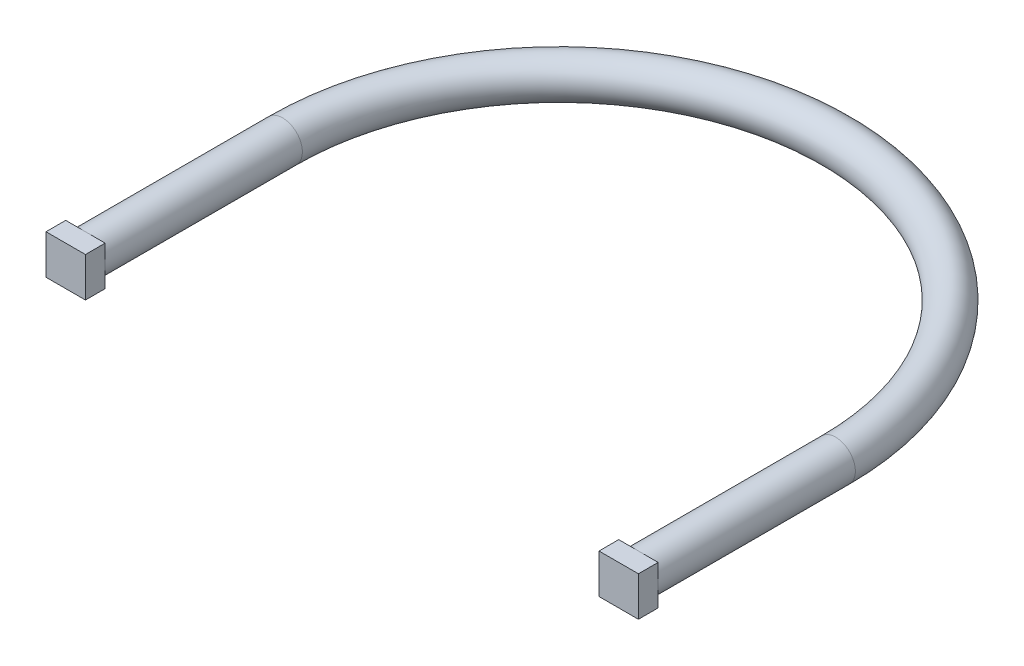
ISO-10303-21;
HEADER;
FILE_DESCRIPTION(('STEP AP214'),'2;1');
FILE_NAME('part.step','',(''),(''),'','','');
FILE_SCHEMA(('AUTOMOTIVE_DESIGN { 1 0 10303 214 1 1 1 1 }'));
ENDSEC;
DATA;
#1=APPLICATION_CONTEXT('core data for automotive mechanical design processes');
#2=APPLICATION_PROTOCOL_DEFINITION('international standard','automotive_design',2000,#1);
#3=PRODUCT_CONTEXT('',#1,'mechanical');
#4=PRODUCT('Part','Part','',(#3));
#5=PRODUCT_RELATED_PRODUCT_CATEGORY('part','',(#4));
#6=PRODUCT_DEFINITION_FORMATION('','',#4);
#7=PRODUCT_DEFINITION_CONTEXT('part definition',#1,'design');
#8=PRODUCT_DEFINITION('design','',#6,#7);
#9=PRODUCT_DEFINITION_SHAPE('','',#8);
#10=(LENGTH_UNIT() NAMED_UNIT(*) SI_UNIT(.MILLI.,.METRE.));
#11=(NAMED_UNIT(*) PLANE_ANGLE_UNIT() SI_UNIT($,.RADIAN.));
#12=(NAMED_UNIT(*) SI_UNIT($,.STERADIAN.) SOLID_ANGLE_UNIT());
#13=UNCERTAINTY_MEASURE_WITH_UNIT(LENGTH_MEASURE(1.E-05),#10,'distance_accuracy_value','');
#14=(GEOMETRIC_REPRESENTATION_CONTEXT(3) GLOBAL_UNCERTAINTY_ASSIGNED_CONTEXT((#13)) GLOBAL_UNIT_ASSIGNED_CONTEXT((#10,
#11,#12)) REPRESENTATION_CONTEXT('',''));
#15=CARTESIAN_POINT('',(0.,0.,0.));
#16=DIRECTION('',(0.,0.,1.));
#17=DIRECTION('',(1.,0.,0.));
#18=AXIS2_PLACEMENT_3D('',#15,#16,#17);
#19=CARTESIAN_POINT('',(140.2,0.,-50.));
#20=DIRECTION('',(0.,0.,1.));
#21=DIRECTION('',(1.,0.,0.));
#22=AXIS2_PLACEMENT_3D('',#19,#20,#21);
#23=CYLINDRICAL_SURFACE('',#22,5.);
#24=CARTESIAN_POINT('',(140.2,0.,-50.));
#25=DIRECTION('',(0.,0.,-1.));
#26=DIRECTION('',(-1.,0.,0.));
#27=AXIS2_PLACEMENT_3D('',#24,#25,#26);
#28=CIRCLE('',#27,5.);
#29=CARTESIAN_POINT('',(145.2,0.,-50.));
#30=VERTEX_POINT('',#29);
#31=EDGE_CURVE('E191',#30,#30,#28,.T.);
#32=ORIENTED_EDGE('',*,*,#31,.F.);
#33=EDGE_LOOP('',(#32));
#34=FACE_BOUND('',#33,.T.);
#35=CARTESIAN_POINT('',(140.2,0.,0.));
#36=DIRECTION('',(0.,0.,-1.));
#37=DIRECTION('',(-1.,0.,0.));
#38=AXIS2_PLACEMENT_3D('',#35,#36,#37);
#39=CIRCLE('',#38,5.);
#40=CARTESIAN_POINT('',(135.2,0.,0.));
#41=VERTEX_POINT('',#40);
#42=CARTESIAN_POINT('',(140.2,5.,0.));
#43=VERTEX_POINT('',#42);
#44=EDGE_CURVE('E11',#41,#43,#39,.T.);
#45=ORIENTED_EDGE('',*,*,#44,.T.);
#46=CARTESIAN_POINT('',(145.2,0.,0.));
#47=VERTEX_POINT('',#46);
#48=EDGE_CURVE('E40',#43,#47,#39,.T.);
#49=ORIENTED_EDGE('',*,*,#48,.T.);
#50=CARTESIAN_POINT('',(140.2,-5.,0.));
#51=VERTEX_POINT('',#50);
#52=EDGE_CURVE('E199',#47,#51,#39,.T.);
#53=ORIENTED_EDGE('',*,*,#52,.T.);
#54=EDGE_CURVE('E41',#51,#41,#39,.T.);
#55=ORIENTED_EDGE('',*,*,#54,.T.);
#56=EDGE_LOOP('',(#45,#49,#53,#55));
#57=FACE_BOUND('',#56,.T.);
#58=ADVANCED_FACE('F33',(#34,#57),#23,.T.);
#59=CARTESIAN_POINT('',(70.1,0.,-50.));
#60=DIRECTION('',(0.,-1.,0.));
#61=DIRECTION('',(0.,0.,-1.));
#62=AXIS2_PLACEMENT_3D('',#59,#60,#61);
#63=TOROIDAL_SURFACE('',#62,70.1,5.);
#64=CARTESIAN_POINT('',(0.,0.,-50.));
#65=DIRECTION('',(0.,0.,1.));
#66=DIRECTION('',(1.,0.,0.));
#67=AXIS2_PLACEMENT_3D('',#64,#65,#66);
#68=CIRCLE('',#67,5.);
#69=CARTESIAN_POINT('',(-5.,0.,-50.));
#70=VERTEX_POINT('',#69);
#71=EDGE_CURVE('E188',#70,#70,#68,.T.);
#72=CARTESIAN_POINT('',(70.1,0.,-50.));
#73=DIRECTION('',(0.,-1.,0.));
#74=DIRECTION('',(0.,0.,-1.));
#75=AXIS2_PLACEMENT_3D('',#72,#73,#74);
#76=CIRCLE('',#75,75.1);
#77=EDGE_CURVE('',#70,#30,#76,.T.);
#78=ORIENTED_EDGE('',*,*,#71,.F.);
#79=ORIENTED_EDGE('',*,*,#31,.T.);
#80=ORIENTED_EDGE('',*,*,#77,.T.);
#81=ORIENTED_EDGE('',*,*,#77,.F.);
#82=EDGE_LOOP('',(#78,#80,#79,#81));
#83=FACE_BOUND('',#82,.T.);
#84=ADVANCED_FACE('F247',(#83),#63,.T.);
#85=CARTESIAN_POINT('',(0.,0.,-50.));
#86=DIRECTION('',(0.,0.,1.));
#87=DIRECTION('',(1.,0.,0.));
#88=AXIS2_PLACEMENT_3D('',#85,#86,#87);
#89=CYLINDRICAL_SURFACE('',#88,5.);
#90=ORIENTED_EDGE('',*,*,#71,.T.);
#91=EDGE_LOOP('',(#90));
#92=FACE_BOUND('',#91,.T.);
#93=CARTESIAN_POINT('',(0.,0.,0.));
#94=DIRECTION('',(0.,0.,1.));
#95=DIRECTION('',(1.,0.,0.));
#96=AXIS2_PLACEMENT_3D('',#93,#94,#95);
#97=CIRCLE('',#96,5.);
#98=CARTESIAN_POINT('',(5.,0.,0.));
#99=VERTEX_POINT('',#98);
#100=CARTESIAN_POINT('',(0.,5.,0.));
#101=VERTEX_POINT('',#100);
#102=EDGE_CURVE('E192',#99,#101,#97,.T.);
#103=ORIENTED_EDGE('',*,*,#102,.F.);
#104=CARTESIAN_POINT('',(0.,-5.,0.));
#105=VERTEX_POINT('',#104);
#106=EDGE_CURVE('E56',#105,#99,#97,.T.);
#107=ORIENTED_EDGE('',*,*,#106,.F.);
#108=CARTESIAN_POINT('',(-5.,0.,0.));
#109=VERTEX_POINT('',#108);
#110=EDGE_CURVE('E430',#109,#105,#97,.T.);
#111=ORIENTED_EDGE('',*,*,#110,.F.);
#112=EDGE_CURVE('E194',#101,#109,#97,.T.);
#113=ORIENTED_EDGE('',*,*,#112,.F.);
#114=EDGE_LOOP('',(#103,#107,#111,#113));
#115=FACE_BOUND('',#114,.T.);
#116=ADVANCED_FACE('F252',(#92,#115),#89,.T.);
#117=CARTESIAN_POINT('',(0.,0.,0.));
#118=DIRECTION('',(0.,0.,-1.));
#119=DIRECTION('',(-1.,0.,0.));
#120=AXIS2_PLACEMENT_3D('',#117,#118,#119);
#121=PLANE('',#120);
#122=DIRECTION('',(0.,1.,0.));
#123=VECTOR('',#122,1.);
#124=CARTESIAN_POINT('',(5.,5.,0.));
#125=LINE('',#124,#123);
#126=CARTESIAN_POINT('',(5.,5.,0.));
#127=VERTEX_POINT('',#126);
#128=EDGE_CURVE('E146',#99,#127,#125,.T.);
#129=ORIENTED_EDGE('',*,*,#128,.F.);
#130=ORIENTED_EDGE('',*,*,#102,.T.);
#131=DIRECTION('',(-1.,0.,0.));
#132=VECTOR('',#131,1.);
#133=CARTESIAN_POINT('',(-5.,5.,0.));
#134=LINE('',#133,#132);
#135=EDGE_CURVE('E167',#127,#101,#134,.T.);
#136=ORIENTED_EDGE('',*,*,#135,.F.);
#137=EDGE_LOOP('',(#129,#130,#136));
#138=FACE_BOUND('',#137,.T.);
#139=ADVANCED_FACE('F257',(#138),#121,.T.);
#140=CARTESIAN_POINT('',(-5.,5.,0.));
#141=VERTEX_POINT('',#140);
#142=EDGE_CURVE('E166',#101,#141,#134,.T.);
#143=ORIENTED_EDGE('',*,*,#142,.F.);
#144=ORIENTED_EDGE('',*,*,#112,.T.);
#145=DIRECTION('',(0.,-1.,0.));
#146=VECTOR('',#145,1.);
#147=CARTESIAN_POINT('',(-5.,-5.,0.));
#148=LINE('',#147,#146);
#149=EDGE_CURVE('E171',#141,#109,#148,.T.);
#150=ORIENTED_EDGE('',*,*,#149,.F.);
#151=EDGE_LOOP('',(#143,#144,#150));
#152=FACE_BOUND('',#151,.T.);
#153=ADVANCED_FACE('F393',(#152),#121,.T.);
#154=CARTESIAN_POINT('',(-5.,-5.,0.));
#155=VERTEX_POINT('',#154);
#156=EDGE_CURVE('E170',#109,#155,#148,.T.);
#157=ORIENTED_EDGE('',*,*,#156,.F.);
#158=ORIENTED_EDGE('',*,*,#110,.T.);
#159=DIRECTION('',(1.,0.,0.));
#160=VECTOR('',#159,1.);
#161=CARTESIAN_POINT('',(5.,-5.,0.));
#162=LINE('',#161,#160);
#163=EDGE_CURVE('E158',#155,#105,#162,.T.);
#164=ORIENTED_EDGE('',*,*,#163,.F.);
#165=EDGE_LOOP('',(#157,#158,#164));
#166=FACE_BOUND('',#165,.T.);
#167=ADVANCED_FACE('F266',(#166),#121,.T.);
#168=CARTESIAN_POINT('',(5.,5.,5.));
#169=DIRECTION('',(-1.,0.,0.));
#170=DIRECTION('',(0.,0.,1.));
#171=AXIS2_PLACEMENT_3D('',#168,#169,#170);
#172=PLANE('',#171);
#173=CARTESIAN_POINT('',(5.,-5.,0.));
#174=VERTEX_POINT('',#173);
#175=EDGE_CURVE('E148',#174,#99,#125,.T.);
#176=ORIENTED_EDGE('',*,*,#175,.T.);
#177=ORIENTED_EDGE('',*,*,#128,.T.);
#178=DIRECTION('',(0.,0.,-1.));
#179=VECTOR('',#178,1.);
#180=CARTESIAN_POINT('',(5.,5.,5.));
#181=LINE('',#180,#179);
#182=CARTESIAN_POINT('',(5.,5.,5.));
#183=VERTEX_POINT('',#182);
#184=EDGE_CURVE('E185',#183,#127,#181,.T.);
#185=ORIENTED_EDGE('',*,*,#184,.F.);
#186=DIRECTION('',(0.,1.,0.));
#187=VECTOR('',#186,1.);
#188=CARTESIAN_POINT('',(5.,5.,5.));
#189=LINE('',#188,#187);
#190=CARTESIAN_POINT('',(5.,-5.,5.));
#191=VERTEX_POINT('',#190);
#192=EDGE_CURVE('E154',#191,#183,#189,.T.);
#193=ORIENTED_EDGE('',*,*,#192,.F.);
#194=DIRECTION('',(0.,0.,-1.));
#195=VECTOR('',#194,1.);
#196=CARTESIAN_POINT('',(5.,-5.,5.));
#197=LINE('',#196,#195);
#198=EDGE_CURVE('E163',#191,#174,#197,.T.);
#199=ORIENTED_EDGE('',*,*,#198,.T.);
#200=EDGE_LOOP('',(#176,#177,#185,#193,#199));
#201=FACE_BOUND('',#200,.T.);
#202=ADVANCED_FACE('F262',(#201),#172,.F.);
#203=CARTESIAN_POINT('',(-5.,5.,5.));
#204=DIRECTION('',(0.,-1.,0.));
#205=DIRECTION('',(0.,0.,-1.));
#206=AXIS2_PLACEMENT_3D('',#203,#204,#205);
#207=PLANE('',#206);
#208=ORIENTED_EDGE('',*,*,#135,.T.);
#209=ORIENTED_EDGE('',*,*,#142,.T.);
#210=DIRECTION('',(0.,0.,-1.));
#211=VECTOR('',#210,1.);
#212=CARTESIAN_POINT('',(-5.,5.,5.));
#213=LINE('',#212,#211);
#214=CARTESIAN_POINT('',(-5.,5.,5.));
#215=VERTEX_POINT('',#214);
#216=EDGE_CURVE('E182',#215,#141,#213,.T.);
#217=ORIENTED_EDGE('',*,*,#216,.F.);
#218=DIRECTION('',(-1.,0.,0.));
#219=VECTOR('',#218,1.);
#220=CARTESIAN_POINT('',(-5.,5.,5.));
#221=LINE('',#220,#219);
#222=EDGE_CURVE('E157',#183,#215,#221,.T.);
#223=ORIENTED_EDGE('',*,*,#222,.F.);
#224=ORIENTED_EDGE('',*,*,#184,.T.);
#225=EDGE_LOOP('',(#208,#209,#217,#223,#224));
#226=FACE_BOUND('',#225,.T.);
#227=ADVANCED_FACE('F265',(#226),#207,.F.);
#228=CARTESIAN_POINT('',(-5.,-5.,5.));
#229=DIRECTION('',(1.,0.,0.));
#230=DIRECTION('',(0.,0.,-1.));
#231=AXIS2_PLACEMENT_3D('',#228,#229,#230);
#232=PLANE('',#231);
#233=ORIENTED_EDGE('',*,*,#149,.T.);
#234=ORIENTED_EDGE('',*,*,#156,.T.);
#235=DIRECTION('',(0.,0.,-1.));
#236=VECTOR('',#235,1.);
#237=CARTESIAN_POINT('',(-5.,-5.,5.));
#238=LINE('',#237,#236);
#239=CARTESIAN_POINT('',(-5.,-5.,5.));
#240=VERTEX_POINT('',#239);
#241=EDGE_CURVE('E179',#240,#155,#238,.T.);
#242=ORIENTED_EDGE('',*,*,#241,.F.);
#243=DIRECTION('',(0.,-1.,0.));
#244=VECTOR('',#243,1.);
#245=CARTESIAN_POINT('',(-5.,-5.,5.));
#246=LINE('',#245,#244);
#247=EDGE_CURVE('E160',#215,#240,#246,.T.);
#248=ORIENTED_EDGE('',*,*,#247,.F.);
#249=ORIENTED_EDGE('',*,*,#216,.T.);
#250=EDGE_LOOP('',(#233,#234,#242,#248,#249));
#251=FACE_BOUND('',#250,.T.);
#252=ADVANCED_FACE('F270',(#251),#232,.F.);
#253=CARTESIAN_POINT('',(5.,-5.,5.));
#254=DIRECTION('',(0.,1.,0.));
#255=DIRECTION('',(-1.,0.,0.));
#256=AXIS2_PLACEMENT_3D('',#253,#254,#255);
#257=PLANE('',#256);
#258=ORIENTED_EDGE('',*,*,#163,.T.);
#259=EDGE_CURVE('E174',#105,#174,#162,.T.);
#260=ORIENTED_EDGE('',*,*,#259,.T.);
#261=ORIENTED_EDGE('',*,*,#198,.F.);
#262=DIRECTION('',(1.,0.,0.));
#263=VECTOR('',#262,1.);
#264=CARTESIAN_POINT('',(5.,-5.,5.));
#265=LINE('',#264,#263);
#266=EDGE_CURVE('E162',#240,#191,#265,.T.);
#267=ORIENTED_EDGE('',*,*,#266,.F.);
#268=ORIENTED_EDGE('',*,*,#241,.T.);
#269=EDGE_LOOP('',(#258,#260,#261,#267,#268));
#270=FACE_BOUND('',#269,.T.);
#271=ADVANCED_FACE('F274',(#270),#257,.F.);
#272=CARTESIAN_POINT('',(0.,0.,5.));
#273=DIRECTION('',(0.,0.,-1.));
#274=DIRECTION('',(-1.,0.,0.));
#275=AXIS2_PLACEMENT_3D('',#272,#273,#274);
#276=PLANE('',#275);
#277=ORIENTED_EDGE('',*,*,#192,.T.);
#278=ORIENTED_EDGE('',*,*,#222,.T.);
#279=ORIENTED_EDGE('',*,*,#247,.T.);
#280=ORIENTED_EDGE('',*,*,#266,.T.);
#281=EDGE_LOOP('',(#277,#278,#279,#280));
#282=FACE_BOUND('',#281,.T.);
#283=ADVANCED_FACE('F278',(#282),#276,.F.);
#284=ORIENTED_EDGE('',*,*,#259,.F.);
#285=ORIENTED_EDGE('',*,*,#106,.T.);
#286=ORIENTED_EDGE('',*,*,#175,.F.);
#287=EDGE_LOOP('',(#284,#285,#286));
#288=FACE_BOUND('',#287,.T.);
#289=ADVANCED_FACE('F280',(#288),#121,.T.);
#290=CARTESIAN_POINT('',(0.,0.,0.));
#291=DIRECTION('',(0.,0.,-1.));
#292=DIRECTION('',(-1.,0.,0.));
#293=AXIS2_PLACEMENT_3D('',#290,#291,#292);
#294=PLANE('',#293);
#295=ORIENTED_EDGE('',*,*,#44,.F.);
#296=DIRECTION('',(0.,-1.,0.));
#297=VECTOR('',#296,1.);
#298=CARTESIAN_POINT('',(135.2,-5.,0.));
#299=LINE('',#298,#297);
#300=CARTESIAN_POINT('',(135.2,5.,0.));
#301=VERTEX_POINT('',#300);
#302=EDGE_CURVE('E48',#301,#41,#299,.T.);
#303=ORIENTED_EDGE('',*,*,#302,.F.);
#304=DIRECTION('',(-1.,0.,0.));
#305=VECTOR('',#304,1.);
#306=CARTESIAN_POINT('',(135.2,5.,0.));
#307=LINE('',#306,#305);
#308=EDGE_CURVE('E213',#43,#301,#307,.T.);
#309=ORIENTED_EDGE('',*,*,#308,.F.);
#310=EDGE_LOOP('',(#295,#303,#309));
#311=FACE_BOUND('',#310,.T.);
#312=ADVANCED_FACE('F214',(#311),#294,.T.);
#313=ORIENTED_EDGE('',*,*,#48,.F.);
#314=CARTESIAN_POINT('',(145.2,5.,0.));
#315=VERTEX_POINT('',#314);
#316=EDGE_CURVE('E141',#315,#43,#307,.T.);
#317=ORIENTED_EDGE('',*,*,#316,.F.);
#318=DIRECTION('',(0.,1.,0.));
#319=VECTOR('',#318,1.);
#320=CARTESIAN_POINT('',(145.2,-5.,0.));
#321=LINE('',#320,#319);
#322=EDGE_CURVE('E210',#47,#315,#321,.T.);
#323=ORIENTED_EDGE('',*,*,#322,.F.);
#324=EDGE_LOOP('',(#313,#317,#323));
#325=FACE_BOUND('',#324,.T.);
#326=ADVANCED_FACE('F208',(#325),#294,.T.);
#327=ORIENTED_EDGE('',*,*,#52,.F.);
#328=CARTESIAN_POINT('',(145.2,-5.,0.));
#329=VERTEX_POINT('',#328);
#330=EDGE_CURVE('E216',#329,#47,#321,.T.);
#331=ORIENTED_EDGE('',*,*,#330,.F.);
#332=DIRECTION('',(1.,0.,0.));
#333=VECTOR('',#332,1.);
#334=CARTESIAN_POINT('',(135.2,-5.,0.));
#335=LINE('',#334,#333);
#336=EDGE_CURVE('E228',#51,#329,#335,.T.);
#337=ORIENTED_EDGE('',*,*,#336,.F.);
#338=EDGE_LOOP('',(#327,#331,#337));
#339=FACE_BOUND('',#338,.T.);
#340=ADVANCED_FACE('F235',(#339),#294,.T.);
#341=ORIENTED_EDGE('',*,*,#54,.F.);
#342=CARTESIAN_POINT('',(135.2,-5.,0.));
#343=VERTEX_POINT('',#342);
#344=EDGE_CURVE('E229',#343,#51,#335,.T.);
#345=ORIENTED_EDGE('',*,*,#344,.F.);
#346=EDGE_CURVE('E144',#41,#343,#299,.T.);
#347=ORIENTED_EDGE('',*,*,#346,.F.);
#348=EDGE_LOOP('',(#341,#345,#347));
#349=FACE_BOUND('',#348,.T.);
#350=ADVANCED_FACE('F237',(#349),#294,.T.);
#351=CARTESIAN_POINT('',(135.2,-5.,5.));
#352=DIRECTION('',(1.,0.,0.));
#353=DIRECTION('',(0.,0.,-1.));
#354=AXIS2_PLACEMENT_3D('',#351,#352,#353);
#355=PLANE('',#354);
#356=ORIENTED_EDGE('',*,*,#302,.T.);
#357=ORIENTED_EDGE('',*,*,#346,.T.);
#358=DIRECTION('',(0.,0.,-1.));
#359=VECTOR('',#358,1.);
#360=CARTESIAN_POINT('',(135.2,-5.,5.));
#361=LINE('',#360,#359);
#362=CARTESIAN_POINT('',(135.2,-5.,5.));
#363=VERTEX_POINT('',#362);
#364=EDGE_CURVE('E128',#363,#343,#361,.T.);
#365=ORIENTED_EDGE('',*,*,#364,.F.);
#366=DIRECTION('',(0.,-1.,0.));
#367=VECTOR('',#366,1.);
#368=CARTESIAN_POINT('',(135.2,-5.,5.));
#369=LINE('',#368,#367);
#370=CARTESIAN_POINT('',(135.2,5.,5.));
#371=VERTEX_POINT('',#370);
#372=EDGE_CURVE('E134',#371,#363,#369,.T.);
#373=ORIENTED_EDGE('',*,*,#372,.F.);
#374=DIRECTION('',(0.,0.,-1.));
#375=VECTOR('',#374,1.);
#376=CARTESIAN_POINT('',(135.2,5.,5.));
#377=LINE('',#376,#375);
#378=EDGE_CURVE('E224',#371,#301,#377,.T.);
#379=ORIENTED_EDGE('',*,*,#378,.T.);
#380=EDGE_LOOP('',(#356,#357,#365,#373,#379));
#381=FACE_BOUND('',#380,.T.);
#382=ADVANCED_FACE('F143',(#381),#355,.F.);
#383=CARTESIAN_POINT('',(135.2,-5.,5.));
#384=DIRECTION('',(0.,1.,0.));
#385=DIRECTION('',(-1.,0.,0.));
#386=AXIS2_PLACEMENT_3D('',#383,#384,#385);
#387=PLANE('',#386);
#388=ORIENTED_EDGE('',*,*,#344,.T.);
#389=ORIENTED_EDGE('',*,*,#336,.T.);
#390=DIRECTION('',(0.,0.,-1.));
#391=VECTOR('',#390,1.);
#392=CARTESIAN_POINT('',(145.2,-5.,5.));
#393=LINE('',#392,#391);
#394=CARTESIAN_POINT('',(145.2,-5.,5.));
#395=VERTEX_POINT('',#394);
#396=EDGE_CURVE('E130',#395,#329,#393,.T.);
#397=ORIENTED_EDGE('',*,*,#396,.F.);
#398=DIRECTION('',(1.,0.,0.));
#399=VECTOR('',#398,1.);
#400=CARTESIAN_POINT('',(135.2,-5.,5.));
#401=LINE('',#400,#399);
#402=EDGE_CURVE('E123',#363,#395,#401,.T.);
#403=ORIENTED_EDGE('',*,*,#402,.F.);
#404=ORIENTED_EDGE('',*,*,#364,.T.);
#405=EDGE_LOOP('',(#388,#389,#397,#403,#404));
#406=FACE_BOUND('',#405,.T.);
#407=ADVANCED_FACE('F126',(#406),#387,.F.);
#408=CARTESIAN_POINT('',(145.2,-5.,5.));
#409=DIRECTION('',(-1.,0.,0.));
#410=DIRECTION('',(0.,0.,1.));
#411=AXIS2_PLACEMENT_3D('',#408,#409,#410);
#412=PLANE('',#411);
#413=ORIENTED_EDGE('',*,*,#330,.T.);
#414=ORIENTED_EDGE('',*,*,#322,.T.);
#415=DIRECTION('',(0.,0.,-1.));
#416=VECTOR('',#415,1.);
#417=CARTESIAN_POINT('',(145.2,5.,5.));
#418=LINE('',#417,#416);
#419=CARTESIAN_POINT('',(145.2,5.,5.));
#420=VERTEX_POINT('',#419);
#421=EDGE_CURVE('E150',#420,#315,#418,.T.);
#422=ORIENTED_EDGE('',*,*,#421,.F.);
#423=DIRECTION('',(0.,1.,0.));
#424=VECTOR('',#423,1.);
#425=CARTESIAN_POINT('',(145.2,-5.,5.));
#426=LINE('',#425,#424);
#427=EDGE_CURVE('E133',#395,#420,#426,.T.);
#428=ORIENTED_EDGE('',*,*,#427,.F.);
#429=ORIENTED_EDGE('',*,*,#396,.T.);
#430=EDGE_LOOP('',(#413,#414,#422,#428,#429));
#431=FACE_BOUND('',#430,.T.);
#432=ADVANCED_FACE('F234',(#431),#412,.F.);
#433=CARTESIAN_POINT('',(135.2,5.,5.));
#434=DIRECTION('',(0.,-1.,0.));
#435=DIRECTION('',(1.,0.,0.));
#436=AXIS2_PLACEMENT_3D('',#433,#434,#435);
#437=PLANE('',#436);
#438=ORIENTED_EDGE('',*,*,#316,.T.);
#439=ORIENTED_EDGE('',*,*,#308,.T.);
#440=ORIENTED_EDGE('',*,*,#378,.F.);
#441=DIRECTION('',(-1.,0.,0.));
#442=VECTOR('',#441,1.);
#443=CARTESIAN_POINT('',(135.2,5.,5.));
#444=LINE('',#443,#442);
#445=EDGE_CURVE('E139',#420,#371,#444,.T.);
#446=ORIENTED_EDGE('',*,*,#445,.F.);
#447=ORIENTED_EDGE('',*,*,#421,.T.);
#448=EDGE_LOOP('',(#438,#439,#440,#446,#447));
#449=FACE_BOUND('',#448,.T.);
#450=ADVANCED_FACE('F219',(#449),#437,.F.);
#451=CARTESIAN_POINT('',(0.,0.,5.));
#452=DIRECTION('',(0.,0.,-1.));
#453=DIRECTION('',(-1.,0.,0.));
#454=AXIS2_PLACEMENT_3D('',#451,#452,#453);
#455=PLANE('',#454);
#456=ORIENTED_EDGE('',*,*,#372,.T.);
#457=ORIENTED_EDGE('',*,*,#402,.T.);
#458=ORIENTED_EDGE('',*,*,#427,.T.);
#459=ORIENTED_EDGE('',*,*,#445,.T.);
#460=EDGE_LOOP('',(#456,#457,#458,#459));
#461=FACE_BOUND('',#460,.T.);
#462=ADVANCED_FACE('F137',(#461),#455,.F.);
#463=CLOSED_SHELL('',(#58,#84,#116,#139,#153,#167,#202,#227,#252,#271,#283,#289,#312,#326,#340,
#350,#382,#407,#432,#450,#462));
#464=MANIFOLD_SOLID_BREP('B2',#463);
#465=ADVANCED_BREP_SHAPE_REPRESENTATION('',(#18,#464),#14);
#466=SHAPE_DEFINITION_REPRESENTATION(#9,#465);
ENDSEC;
END-ISO-10303-21;
